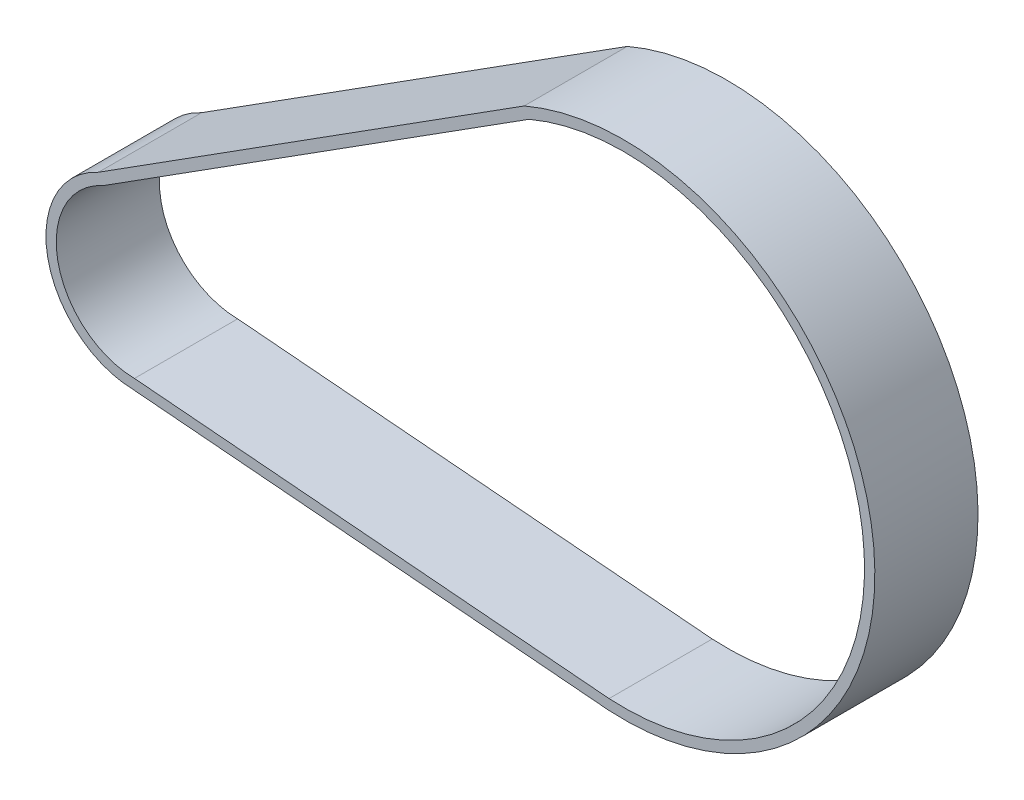
ISO-10303-21;
HEADER;
FILE_DESCRIPTION(('STEP AP214'),'2;1');
FILE_NAME('part.step','',(''),(''),'','','');
FILE_SCHEMA(('AUTOMOTIVE_DESIGN { 1 0 10303 214 1 1 1 1 }'));
ENDSEC;
DATA;
#1=APPLICATION_CONTEXT('core data for automotive mechanical design processes');
#2=APPLICATION_PROTOCOL_DEFINITION('international standard','automotive_design',2000,#1);
#3=PRODUCT_CONTEXT('',#1,'mechanical');
#4=PRODUCT('Part','Part','',(#3));
#5=PRODUCT_RELATED_PRODUCT_CATEGORY('part','',(#4));
#6=PRODUCT_DEFINITION_FORMATION('','',#4);
#7=PRODUCT_DEFINITION_CONTEXT('part definition',#1,'design');
#8=PRODUCT_DEFINITION('design','',#6,#7);
#9=PRODUCT_DEFINITION_SHAPE('','',#8);
#10=(LENGTH_UNIT() NAMED_UNIT(*) SI_UNIT(.MILLI.,.METRE.));
#11=(NAMED_UNIT(*) PLANE_ANGLE_UNIT() SI_UNIT($,.RADIAN.));
#12=(NAMED_UNIT(*) SI_UNIT($,.STERADIAN.) SOLID_ANGLE_UNIT());
#13=UNCERTAINTY_MEASURE_WITH_UNIT(LENGTH_MEASURE(1.E-05),#10,'distance_accuracy_value','');
#14=(GEOMETRIC_REPRESENTATION_CONTEXT(3) GLOBAL_UNCERTAINTY_ASSIGNED_CONTEXT((#13)) GLOBAL_UNIT_ASSIGNED_CONTEXT((#10,
#11,#12)) REPRESENTATION_CONTEXT('',''));
#15=CARTESIAN_POINT('',(0.,0.,0.));
#16=DIRECTION('',(0.,0.,1.));
#17=DIRECTION('',(1.,0.,0.));
#18=AXIS2_PLACEMENT_3D('',#15,#16,#17);
#19=CARTESIAN_POINT('',(0.,0.,15.));
#20=DIRECTION('',(0.,0.,1.));
#21=DIRECTION('',(1.,0.,0.));
#22=AXIS2_PLACEMENT_3D('',#19,#20,#21);
#23=PLANE('',#22);
#24=CARTESIAN_POINT('',(0.,0.,15.));
#25=DIRECTION('',(0.,0.,1.));
#26=DIRECTION('',(1.,0.,0.));
#27=AXIS2_PLACEMENT_3D('',#24,#25,#26);
#28=CIRCLE('',#27,13.);
#29=CARTESIAN_POINT('',(-5.3673490212833,11.8402518758567,15.));
#30=VERTEX_POINT('',#29);
#31=CARTESIAN_POINT('',(-0.204046973087823,-12.9983985487741,15.));
#32=VERTEX_POINT('',#31);
#33=EDGE_CURVE('E153',#30,#32,#28,.T.);
#34=ORIENTED_EDGE('',*,*,#33,.T.);
#35=DIRECTION('',(0.996476110179143,-0.0838770638628006,0.));
#36=VECTOR('',#35,1.);
#37=CARTESIAN_POINT('',(68.7554580932214,-18.8029740436689,15.));
#38=LINE('',#37,#36);
#39=CARTESIAN_POINT('',(68.7554580932214,-18.8029740436689,15.));
#40=VERTEX_POINT('',#39);
#41=EDGE_CURVE('E157',#32,#40,#38,.T.);
#42=ORIENTED_EDGE('',*,*,#41,.T.);
#43=CARTESIAN_POINT('',(71.0038055554075,17.6277126598408,15.));
#44=DIRECTION('',(0.,0.,1.));
#45=DIRECTION('',(1.,0.,0.));
#46=AXIS2_PLACEMENT_3D('',#43,#44,#45);
#47=CIRCLE('',#46,36.5);
#48=CARTESIAN_POINT('',(56.5276569701149,51.1342959254698,15.));
#49=VERTEX_POINT('',#48);
#50=EDGE_CURVE('E161',#40,#49,#47,.T.);
#51=ORIENTED_EDGE('',*,*,#50,.T.);
#52=DIRECTION('',(-0.844239801430291,-0.535965631063171,0.));
#53=VECTOR('',#52,1.);
#54=CARTESIAN_POINT('',(-5.3673490212833,11.8402518758567,15.));
#55=LINE('',#54,#53);
#56=EDGE_CURVE('E164',#49,#30,#55,.T.);
#57=ORIENTED_EDGE('',*,*,#56,.T.);
#58=EDGE_LOOP('',(#34,#42,#51,#57));
#59=FACE_BOUND('',#58,.T.);
#60=DIRECTION('',(0.996476110179143,-0.0838770638628006,0.));
#61=VECTOR('',#60,1.);
#62=CARTESIAN_POINT('',(68.8644032568219,-17.3068398319946,15.));
#63=LINE('',#62,#61);
#64=CARTESIAN_POINT('',(-0.130846250690007,-11.4992555958497,15.));
#65=VERTEX_POINT('',#64);
#66=CARTESIAN_POINT('',(68.8644032568219,-17.3068398319946,15.));
#67=VERTEX_POINT('',#66);
#68=EDGE_CURVE('E114',#65,#67,#63,.T.);
#69=ORIENTED_EDGE('',*,*,#68,.F.);
#70=CARTESIAN_POINT('',(0.,0.,15.));
#71=DIRECTION('',(0.,0.,1.));
#72=DIRECTION('',(1.,0.,0.));
#73=AXIS2_PLACEMENT_3D('',#70,#71,#72);
#74=CIRCLE('',#73,11.5);
#75=CARTESIAN_POINT('',(-4.65495512545482,10.5157687679029,15.));
#76=VERTEX_POINT('',#75);
#77=EDGE_CURVE('E105',#76,#65,#74,.T.);
#78=ORIENTED_EDGE('',*,*,#77,.F.);
#79=DIRECTION('',(-0.844239801430291,-0.535965631063171,0.));
#80=VECTOR('',#79,1.);
#81=CARTESIAN_POINT('',(-4.65495512545482,10.5157687679029,15.));
#82=LINE('',#81,#80);
#83=CARTESIAN_POINT('',(57.2304030998213,49.8036879332719,15.));
#84=VERTEX_POINT('',#83);
#85=EDGE_CURVE('E131',#84,#76,#82,.T.);
#86=ORIENTED_EDGE('',*,*,#85,.F.);
#87=CARTESIAN_POINT('',(71.0038055554075,17.6277126598408,15.));
#88=DIRECTION('',(0.,0.,1.));
#89=DIRECTION('',(1.,0.,0.));
#90=AXIS2_PLACEMENT_3D('',#87,#88,#89);
#91=CIRCLE('',#90,35.);
#92=EDGE_CURVE('E127',#67,#84,#91,.T.);
#93=ORIENTED_EDGE('',*,*,#92,.F.);
#94=EDGE_LOOP('',(#69,#78,#86,#93));
#95=FACE_BOUND('',#94,.T.);
#96=ADVANCED_FACE('F39',(#59,#95),#23,.T.);
#97=CARTESIAN_POINT('',(0.,0.,0.));
#98=DIRECTION('',(0.,0.,1.));
#99=DIRECTION('',(1.,0.,0.));
#100=AXIS2_PLACEMENT_3D('',#97,#98,#99);
#101=PLANE('',#100);
#102=CARTESIAN_POINT('',(0.,0.,0.));
#103=DIRECTION('',(0.,0.,1.));
#104=DIRECTION('',(1.,0.,0.));
#105=AXIS2_PLACEMENT_3D('',#102,#103,#104);
#106=CIRCLE('',#105,13.);
#107=CARTESIAN_POINT('',(-5.3673490212833,11.8402518758567,0.));
#108=VERTEX_POINT('',#107);
#109=CARTESIAN_POINT('',(-0.204046973087823,-12.9983985487741,0.));
#110=VERTEX_POINT('',#109);
#111=EDGE_CURVE('E123',#108,#110,#106,.T.);
#112=ORIENTED_EDGE('',*,*,#111,.F.);
#113=DIRECTION('',(-0.844239801430291,-0.535965631063171,0.));
#114=VECTOR('',#113,1.);
#115=CARTESIAN_POINT('',(-5.3673490212833,11.8402518758567,0.));
#116=LINE('',#115,#114);
#117=CARTESIAN_POINT('',(56.5276569701149,51.1342959254698,0.));
#118=VERTEX_POINT('',#117);
#119=EDGE_CURVE('E158',#118,#108,#116,.T.);
#120=ORIENTED_EDGE('',*,*,#119,.F.);
#121=CARTESIAN_POINT('',(71.0038055554075,17.6277126598408,0.));
#122=DIRECTION('',(0.,0.,1.));
#123=DIRECTION('',(1.,0.,0.));
#124=AXIS2_PLACEMENT_3D('',#121,#122,#123);
#125=CIRCLE('',#124,36.5);
#126=CARTESIAN_POINT('',(68.7554580932214,-18.8029740436689,0.));
#127=VERTEX_POINT('',#126);
#128=EDGE_CURVE('E174',#127,#118,#125,.T.);
#129=ORIENTED_EDGE('',*,*,#128,.F.);
#130=DIRECTION('',(0.996476110179143,-0.0838770638628006,0.));
#131=VECTOR('',#130,1.);
#132=CARTESIAN_POINT('',(68.7554580932214,-18.8029740436689,0.));
#133=LINE('',#132,#131);
#134=EDGE_CURVE('E171',#110,#127,#133,.T.);
#135=ORIENTED_EDGE('',*,*,#134,.F.);
#136=EDGE_LOOP('',(#112,#120,#129,#135));
#137=FACE_BOUND('',#136,.T.);
#138=CARTESIAN_POINT('',(0.,0.,0.));
#139=DIRECTION('',(0.,0.,1.));
#140=DIRECTION('',(1.,0.,0.));
#141=AXIS2_PLACEMENT_3D('',#138,#139,#140);
#142=CIRCLE('',#141,11.5);
#143=CARTESIAN_POINT('',(-4.65495512545482,10.5157687679029,0.));
#144=VERTEX_POINT('',#143);
#145=CARTESIAN_POINT('',(-0.130846250690007,-11.4992555958497,0.));
#146=VERTEX_POINT('',#145);
#147=EDGE_CURVE('E63',#144,#146,#142,.T.);
#148=ORIENTED_EDGE('',*,*,#147,.T.);
#149=DIRECTION('',(0.996476110179143,-0.0838770638628006,0.));
#150=VECTOR('',#149,1.);
#151=CARTESIAN_POINT('',(68.8644032568219,-17.3068398319946,0.));
#152=LINE('',#151,#150);
#153=CARTESIAN_POINT('',(68.8644032568219,-17.3068398319946,0.));
#154=VERTEX_POINT('',#153);
#155=EDGE_CURVE('E121',#146,#154,#152,.T.);
#156=ORIENTED_EDGE('',*,*,#155,.T.);
#157=CARTESIAN_POINT('',(71.0038055554075,17.6277126598408,0.));
#158=DIRECTION('',(0.,0.,1.));
#159=DIRECTION('',(1.,0.,0.));
#160=AXIS2_PLACEMENT_3D('',#157,#158,#159);
#161=CIRCLE('',#160,35.);
#162=CARTESIAN_POINT('',(57.2304030998213,49.8036879332719,0.));
#163=VERTEX_POINT('',#162);
#164=EDGE_CURVE('E140',#154,#163,#161,.T.);
#165=ORIENTED_EDGE('',*,*,#164,.T.);
#166=DIRECTION('',(-0.844239801430291,-0.535965631063171,0.));
#167=VECTOR('',#166,1.);
#168=CARTESIAN_POINT('',(-4.65495512545482,10.5157687679029,0.));
#169=LINE('',#168,#167);
#170=EDGE_CURVE('E115',#163,#144,#169,.T.);
#171=ORIENTED_EDGE('',*,*,#170,.T.);
#172=EDGE_LOOP('',(#148,#156,#165,#171));
#173=FACE_BOUND('',#172,.T.);
#174=ADVANCED_FACE('F197',(#137,#173),#101,.F.);
#175=CARTESIAN_POINT('',(0.,0.,15.));
#176=DIRECTION('',(0.,0.,-1.));
#177=DIRECTION('',(-1.,0.,0.));
#178=AXIS2_PLACEMENT_3D('',#175,#176,#177);
#179=CYLINDRICAL_SURFACE('',#178,13.);
#180=ORIENTED_EDGE('',*,*,#111,.T.);
#181=DIRECTION('',(0.,0.,-1.));
#182=VECTOR('',#181,1.);
#183=CARTESIAN_POINT('',(-0.204046973087823,-12.9983985487741,15.));
#184=LINE('',#183,#182);
#185=EDGE_CURVE('E11',#32,#110,#184,.T.);
#186=ORIENTED_EDGE('',*,*,#185,.F.);
#187=ORIENTED_EDGE('',*,*,#33,.F.);
#188=DIRECTION('',(0.,0.,-1.));
#189=VECTOR('',#188,1.);
#190=CARTESIAN_POINT('',(-5.3673490212833,11.8402518758567,15.));
#191=LINE('',#190,#189);
#192=EDGE_CURVE('E167',#30,#108,#191,.T.);
#193=ORIENTED_EDGE('',*,*,#192,.T.);
#194=EDGE_LOOP('',(#180,#186,#187,#193));
#195=FACE_BOUND('',#194,.T.);
#196=ADVANCED_FACE('F41',(#195),#179,.T.);
#197=CARTESIAN_POINT('',(68.7554580932214,-18.8029740436689,15.));
#198=DIRECTION('',(0.0838770638628006,0.996476110179143,0.));
#199=DIRECTION('',(-0.996476110179143,0.0838770638628006,0.));
#200=AXIS2_PLACEMENT_3D('',#197,#198,#199);
#201=PLANE('',#200);
#202=ORIENTED_EDGE('',*,*,#134,.T.);
#203=DIRECTION('',(0.,0.,-1.));
#204=VECTOR('',#203,1.);
#205=CARTESIAN_POINT('',(68.7554580932214,-18.8029740436689,15.));
#206=LINE('',#205,#204);
#207=EDGE_CURVE('E48',#40,#127,#206,.T.);
#208=ORIENTED_EDGE('',*,*,#207,.F.);
#209=ORIENTED_EDGE('',*,*,#41,.F.);
#210=ORIENTED_EDGE('',*,*,#185,.T.);
#211=EDGE_LOOP('',(#202,#208,#209,#210));
#212=FACE_BOUND('',#211,.T.);
#213=ADVANCED_FACE('F207',(#212),#201,.F.);
#214=CARTESIAN_POINT('',(71.0038055554075,17.6277126598408,15.));
#215=DIRECTION('',(0.,0.,-1.));
#216=DIRECTION('',(-1.,0.,0.));
#217=AXIS2_PLACEMENT_3D('',#214,#215,#216);
#218=CYLINDRICAL_SURFACE('',#217,36.5);
#219=ORIENTED_EDGE('',*,*,#128,.T.);
#220=DIRECTION('',(0.,0.,-1.));
#221=VECTOR('',#220,1.);
#222=CARTESIAN_POINT('',(56.5276569701149,51.1342959254698,15.));
#223=LINE('',#222,#221);
#224=EDGE_CURVE('E182',#49,#118,#223,.T.);
#225=ORIENTED_EDGE('',*,*,#224,.F.);
#226=ORIENTED_EDGE('',*,*,#50,.F.);
#227=ORIENTED_EDGE('',*,*,#207,.T.);
#228=EDGE_LOOP('',(#219,#225,#226,#227));
#229=FACE_BOUND('',#228,.T.);
#230=ADVANCED_FACE('F191',(#229),#218,.T.);
#231=CARTESIAN_POINT('',(-5.3673490212833,11.8402518758567,15.));
#232=DIRECTION('',(0.53596563106317,-0.844239801430291,0.));
#233=DIRECTION('',(0.844239801430291,0.53596563106317,0.));
#234=AXIS2_PLACEMENT_3D('',#231,#232,#233);
#235=PLANE('',#234);
#236=ORIENTED_EDGE('',*,*,#119,.T.);
#237=ORIENTED_EDGE('',*,*,#192,.F.);
#238=ORIENTED_EDGE('',*,*,#56,.F.);
#239=ORIENTED_EDGE('',*,*,#224,.T.);
#240=EDGE_LOOP('',(#236,#237,#238,#239));
#241=FACE_BOUND('',#240,.T.);
#242=ADVANCED_FACE('F201',(#241),#235,.F.);
#243=CARTESIAN_POINT('',(0.,0.,15.));
#244=DIRECTION('',(0.,0.,-1.));
#245=DIRECTION('',(-1.,0.,0.));
#246=AXIS2_PLACEMENT_3D('',#243,#244,#245);
#247=CYLINDRICAL_SURFACE('',#246,11.5);
#248=ORIENTED_EDGE('',*,*,#147,.F.);
#249=DIRECTION('',(0.,0.,-1.));
#250=VECTOR('',#249,1.);
#251=CARTESIAN_POINT('',(-4.65495512545482,10.5157687679029,15.));
#252=LINE('',#251,#250);
#253=EDGE_CURVE('E109',#76,#144,#252,.T.);
#254=ORIENTED_EDGE('',*,*,#253,.F.);
#255=ORIENTED_EDGE('',*,*,#77,.T.);
#256=DIRECTION('',(0.,0.,-1.));
#257=VECTOR('',#256,1.);
#258=CARTESIAN_POINT('',(-0.130846250690007,-11.4992555958497,15.));
#259=LINE('',#258,#257);
#260=EDGE_CURVE('E108',#65,#146,#259,.T.);
#261=ORIENTED_EDGE('',*,*,#260,.T.);
#262=EDGE_LOOP('',(#248,#254,#255,#261));
#263=FACE_BOUND('',#262,.T.);
#264=ADVANCED_FACE('F107',(#263),#247,.F.);
#265=CARTESIAN_POINT('',(68.8644032568219,-17.3068398319946,15.));
#266=DIRECTION('',(0.0838770638628006,0.996476110179143,0.));
#267=DIRECTION('',(-0.996476110179143,0.0838770638628006,0.));
#268=AXIS2_PLACEMENT_3D('',#265,#266,#267);
#269=PLANE('',#268);
#270=ORIENTED_EDGE('',*,*,#155,.F.);
#271=ORIENTED_EDGE('',*,*,#260,.F.);
#272=ORIENTED_EDGE('',*,*,#68,.T.);
#273=DIRECTION('',(0.,0.,-1.));
#274=VECTOR('',#273,1.);
#275=CARTESIAN_POINT('',(68.8644032568219,-17.3068398319946,15.));
#276=LINE('',#275,#274);
#277=EDGE_CURVE('E124',#67,#154,#276,.T.);
#278=ORIENTED_EDGE('',*,*,#277,.T.);
#279=EDGE_LOOP('',(#270,#271,#272,#278));
#280=FACE_BOUND('',#279,.T.);
#281=ADVANCED_FACE('F118',(#280),#269,.T.);
#282=CARTESIAN_POINT('',(71.0038055554075,17.6277126598408,15.));
#283=DIRECTION('',(0.,0.,-1.));
#284=DIRECTION('',(-1.,0.,0.));
#285=AXIS2_PLACEMENT_3D('',#282,#283,#284);
#286=CYLINDRICAL_SURFACE('',#285,35.);
#287=ORIENTED_EDGE('',*,*,#164,.F.);
#288=ORIENTED_EDGE('',*,*,#277,.F.);
#289=ORIENTED_EDGE('',*,*,#92,.T.);
#290=DIRECTION('',(0.,0.,-1.));
#291=VECTOR('',#290,1.);
#292=CARTESIAN_POINT('',(57.2304030998213,49.8036879332719,15.));
#293=LINE('',#292,#291);
#294=EDGE_CURVE('E55',#84,#163,#293,.T.);
#295=ORIENTED_EDGE('',*,*,#294,.T.);
#296=EDGE_LOOP('',(#287,#288,#289,#295));
#297=FACE_BOUND('',#296,.T.);
#298=ADVANCED_FACE('F230',(#297),#286,.F.);
#299=CARTESIAN_POINT('',(-4.65495512545482,10.5157687679029,15.));
#300=DIRECTION('',(0.535965631063171,-0.844239801430291,0.));
#301=DIRECTION('',(0.844239801430291,0.535965631063171,0.));
#302=AXIS2_PLACEMENT_3D('',#299,#300,#301);
#303=PLANE('',#302);
#304=ORIENTED_EDGE('',*,*,#170,.F.);
#305=ORIENTED_EDGE('',*,*,#294,.F.);
#306=ORIENTED_EDGE('',*,*,#85,.T.);
#307=ORIENTED_EDGE('',*,*,#253,.T.);
#308=EDGE_LOOP('',(#304,#305,#306,#307));
#309=FACE_BOUND('',#308,.T.);
#310=ADVANCED_FACE('F234',(#309),#303,.T.);
#311=CLOSED_SHELL('',(#96,#174,#196,#213,#230,#242,#264,#281,#298,#310));
#312=MANIFOLD_SOLID_BREP('B2',#311);
#313=ADVANCED_BREP_SHAPE_REPRESENTATION('',(#18,#312),#14);
#314=SHAPE_DEFINITION_REPRESENTATION(#9,#313);
ENDSEC;
END-ISO-10303-21;
